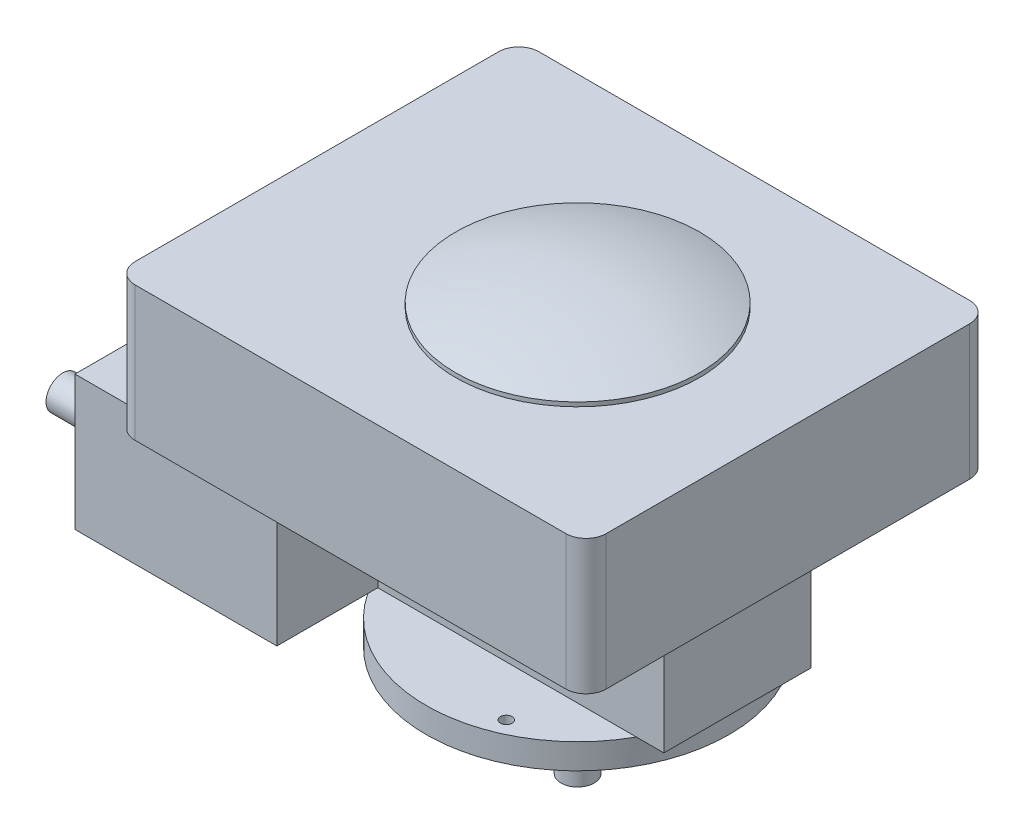
ISO-10303-21;
HEADER;
FILE_DESCRIPTION(('STEP AP214'),'2;1');
FILE_NAME('part.step','',(''),(''),'','','');
FILE_SCHEMA(('AUTOMOTIVE_DESIGN { 1 0 10303 214 1 1 1 1 }'));
ENDSEC;
DATA;
#1=APPLICATION_CONTEXT('core data for automotive mechanical design processes');
#2=APPLICATION_PROTOCOL_DEFINITION('international standard','automotive_design',2000,#1);
#3=PRODUCT_CONTEXT('',#1,'mechanical');
#4=PRODUCT('Part','Part','',(#3));
#5=PRODUCT_RELATED_PRODUCT_CATEGORY('part','',(#4));
#6=PRODUCT_DEFINITION_FORMATION('','',#4);
#7=PRODUCT_DEFINITION_CONTEXT('part definition',#1,'design');
#8=PRODUCT_DEFINITION('design','',#6,#7);
#9=PRODUCT_DEFINITION_SHAPE('','',#8);
#10=(LENGTH_UNIT() NAMED_UNIT(*) SI_UNIT(.MILLI.,.METRE.));
#11=(NAMED_UNIT(*) PLANE_ANGLE_UNIT() SI_UNIT($,.RADIAN.));
#12=(NAMED_UNIT(*) SI_UNIT($,.STERADIAN.) SOLID_ANGLE_UNIT());
#13=UNCERTAINTY_MEASURE_WITH_UNIT(LENGTH_MEASURE(1.E-05),#10,'distance_accuracy_value','');
#14=(GEOMETRIC_REPRESENTATION_CONTEXT(3) GLOBAL_UNCERTAINTY_ASSIGNED_CONTEXT((#13)) GLOBAL_UNIT_ASSIGNED_CONTEXT((#10,
#11,#12)) REPRESENTATION_CONTEXT('',''));
#15=CARTESIAN_POINT('',(0.,0.,0.));
#16=DIRECTION('',(0.,0.,1.));
#17=DIRECTION('',(1.,0.,0.));
#18=AXIS2_PLACEMENT_3D('',#15,#16,#17);
#19=CARTESIAN_POINT('',(-247.65,101.6,-55.5625));
#20=DIRECTION('',(1.,0.,0.));
#21=DIRECTION('',(0.,0.,-1.));
#22=AXIS2_PLACEMENT_3D('',#19,#20,#21);
#23=PLANE('',#22);
#24=DIRECTION('',(0.,0.,1.));
#25=VECTOR('',#24,1.);
#26=CARTESIAN_POINT('',(-247.65,0.,-55.5625));
#27=LINE('',#26,#25);
#28=CARTESIAN_POINT('',(-247.65,0.,-55.5625));
#29=VERTEX_POINT('',#28);
#30=CARTESIAN_POINT('',(-247.65,0.,131.7625));
#31=VERTEX_POINT('',#30);
#32=EDGE_CURVE('E162',#29,#31,#27,.T.);
#33=ORIENTED_EDGE('',*,*,#32,.T.);
#34=DIRECTION('',(0.,-1.,0.));
#35=VECTOR('',#34,1.);
#36=CARTESIAN_POINT('',(-247.65,101.6,131.7625));
#37=LINE('',#36,#35);
#38=CARTESIAN_POINT('',(-247.65,101.6,131.7625));
#39=VERTEX_POINT('',#38);
#40=EDGE_CURVE('E167',#39,#31,#37,.T.);
#41=ORIENTED_EDGE('',*,*,#40,.F.);
#42=DIRECTION('',(0.,0.,1.));
#43=VECTOR('',#42,1.);
#44=CARTESIAN_POINT('',(-247.65,101.6,-55.5625));
#45=LINE('',#44,#43);
#46=CARTESIAN_POINT('',(-247.65,101.6,-55.5625));
#47=VERTEX_POINT('',#46);
#48=EDGE_CURVE('E255',#47,#39,#45,.T.);
#49=ORIENTED_EDGE('',*,*,#48,.F.);
#50=DIRECTION('',(0.,-1.,0.));
#51=VECTOR('',#50,1.);
#52=CARTESIAN_POINT('',(-247.65,101.6,-55.5625));
#53=LINE('',#52,#51);
#54=EDGE_CURVE('E169',#47,#29,#53,.T.);
#55=ORIENTED_EDGE('',*,*,#54,.T.);
#56=EDGE_LOOP('',(#33,#41,#49,#55));
#57=FACE_BOUND('',#56,.T.);
#58=CARTESIAN_POINT('',(-247.65,68.8677449307698,115.540395057253));
#59=DIRECTION('',(1.,0.,0.));
#60=DIRECTION('',(0.,0.,-1.));
#61=AXIS2_PLACEMENT_3D('',#58,#59,#60);
#62=CIRCLE('',#61,12.660326574358);
#63=CARTESIAN_POINT('',(-247.65,68.8677449307698,102.880068482895));
#64=VERTEX_POINT('',#63);
#65=EDGE_CURVE('E12',#64,#64,#62,.F.);
#66=ORIENTED_EDGE('',*,*,#65,.F.);
#67=EDGE_LOOP('',(#66));
#68=FACE_BOUND('',#67,.T.);
#69=ADVANCED_FACE('F39',(#57,#68),#23,.F.);
#70=CARTESIAN_POINT('',(-247.65,101.6,55.5625));
#71=DIRECTION('',(0.,0.,-1.));
#72=DIRECTION('',(-1.,0.,0.));
#73=AXIS2_PLACEMENT_3D('',#70,#71,#72);
#74=PLANE('',#73);
#75=DIRECTION('',(0.,1.,0.));
#76=VECTOR('',#75,1.);
#77=CARTESIAN_POINT('',(-95.2499999999999,101.6,55.5625));
#78=LINE('',#77,#76);
#79=CARTESIAN_POINT('',(-95.2499999999999,0.,55.5625));
#80=VERTEX_POINT('',#79);
#81=CARTESIAN_POINT('',(-95.2499999999999,101.6,55.5625));
#82=VERTEX_POINT('',#81);
#83=EDGE_CURVE('E54',#80,#82,#78,.T.);
#84=ORIENTED_EDGE('',*,*,#83,.F.);
#85=DIRECTION('',(1.,0.,0.));
#86=VECTOR('',#85,1.);
#87=CARTESIAN_POINT('',(-247.65,0.,55.5625));
#88=LINE('',#87,#86);
#89=CARTESIAN_POINT('',(99.886428476295,0.,55.5625));
#90=VERTEX_POINT('',#89);
#91=EDGE_CURVE('E251',#80,#90,#88,.T.);
#92=ORIENTED_EDGE('',*,*,#91,.T.);
#93=CARTESIAN_POINT('',(120.65,0.,55.5625));
#94=VERTEX_POINT('',#93);
#95=EDGE_CURVE('E170',#90,#94,#88,.T.);
#96=ORIENTED_EDGE('',*,*,#95,.T.);
#97=DIRECTION('',(0.,-1.,0.));
#98=VECTOR('',#97,1.);
#99=CARTESIAN_POINT('',(120.65,101.6,55.5625));
#100=LINE('',#99,#98);
#101=CARTESIAN_POINT('',(120.65,101.6,55.5625));
#102=VERTEX_POINT('',#101);
#103=EDGE_CURVE('E259',#102,#94,#100,.T.);
#104=ORIENTED_EDGE('',*,*,#103,.F.);
#105=DIRECTION('',(1.,0.,0.));
#106=VECTOR('',#105,1.);
#107=CARTESIAN_POINT('',(-247.65,101.6,55.5625));
#108=LINE('',#107,#106);
#109=EDGE_CURVE('E257',#82,#102,#108,.T.);
#110=ORIENTED_EDGE('',*,*,#109,.F.);
#111=EDGE_LOOP('',(#84,#92,#96,#104,#110));
#112=FACE_BOUND('',#111,.T.);
#113=ADVANCED_FACE('F384',(#112),#74,.F.);
#114=CARTESIAN_POINT('',(0.,0.,0.));
#115=DIRECTION('',(0.,-1.,0.));
#116=DIRECTION('',(0.,0.,-1.));
#117=AXIS2_PLACEMENT_3D('',#114,#115,#116);
#118=PLANE('',#117);
#119=CARTESIAN_POINT('',(39.624,0.,93.472));
#120=DIRECTION('',(0.,-1.,0.));
#121=DIRECTION('',(0.,0.,-1.));
#122=AXIS2_PLACEMENT_3D('',#119,#120,#121);
#123=CIRCLE('',#122,4.365625);
#124=CARTESIAN_POINT('',(39.624,0.,89.106375));
#125=VERTEX_POINT('',#124);
#126=EDGE_CURVE('E412',#125,#125,#123,.F.);
#127=ORIENTED_EDGE('',*,*,#126,.F.);
#128=EDGE_LOOP('',(#127));
#129=FACE_BOUND('',#128,.T.);
#130=DIRECTION('',(0.,0.,-1.));
#131=VECTOR('',#130,1.);
#132=CARTESIAN_POINT('',(-95.25,0.,131.7625));
#133=LINE('',#132,#131);
#134=CARTESIAN_POINT('',(-95.25,0.,63.1817022562704));
#135=VERTEX_POINT('',#134);
#136=EDGE_CURVE('E198',#135,#80,#133,.T.);
#137=ORIENTED_EDGE('',*,*,#136,.F.);
#138=CARTESIAN_POINT('',(0.,0.,0.));
#139=DIRECTION('',(0.,-1.,0.));
#140=DIRECTION('',(0.,0.,-1.));
#141=AXIS2_PLACEMENT_3D('',#138,#139,#140);
#142=CIRCLE('',#141,114.3);
#143=EDGE_CURVE('E246',#90,#135,#142,.T.);
#144=ORIENTED_EDGE('',*,*,#143,.F.);
#145=ORIENTED_EDGE('',*,*,#91,.F.);
#146=EDGE_LOOP('',(#137,#144,#145));
#147=FACE_BOUND('',#146,.T.);
#148=ADVANCED_FACE('F390',(#129,#147),#118,.F.);
#149=CARTESIAN_POINT('',(0.,101.6,0.));
#150=DIRECTION('',(0.,-1.,0.));
#151=DIRECTION('',(0.,0.,-1.));
#152=AXIS2_PLACEMENT_3D('',#149,#150,#151);
#153=PLANE('',#152);
#154=DIRECTION('',(-1.,0.,0.));
#155=VECTOR('',#154,1.);
#156=CARTESIAN_POINT('',(-247.65,101.6,131.7625));
#157=LINE('',#156,#155);
#158=CARTESIAN_POINT('',(-95.2499999999999,101.6,131.7625));
#159=VERTEX_POINT('',#158);
#160=CARTESIAN_POINT('',(-196.85,101.6,131.7625));
#161=VERTEX_POINT('',#160);
#162=EDGE_CURVE('E194',#159,#161,#157,.T.);
#163=ORIENTED_EDGE('',*,*,#162,.F.);
#164=DIRECTION('',(0.,0.,-1.));
#165=VECTOR('',#164,1.);
#166=CARTESIAN_POINT('',(-95.2499999999999,101.6,131.7625));
#167=LINE('',#166,#165);
#168=EDGE_CURVE('E195',#159,#82,#167,.T.);
#169=ORIENTED_EDGE('',*,*,#168,.T.);
#170=ORIENTED_EDGE('',*,*,#109,.T.);
#171=DIRECTION('',(0.,0.,-1.));
#172=VECTOR('',#171,1.);
#173=CARTESIAN_POINT('',(120.65,101.6,-55.5625));
#174=LINE('',#173,#172);
#175=CARTESIAN_POINT('',(120.65,101.6,-55.5625));
#176=VERTEX_POINT('',#175);
#177=EDGE_CURVE('E247',#102,#176,#174,.T.);
#178=ORIENTED_EDGE('',*,*,#177,.T.);
#179=DIRECTION('',(-1.,0.,0.));
#180=VECTOR('',#179,1.);
#181=CARTESIAN_POINT('',(-247.65,101.6,-55.5625));
#182=LINE('',#181,#180);
#183=CARTESIAN_POINT('',(-196.85,101.6,-55.5625));
#184=VERTEX_POINT('',#183);
#185=EDGE_CURVE('E252',#176,#184,#182,.T.);
#186=ORIENTED_EDGE('',*,*,#185,.T.);
#187=DIRECTION('',(0.,0.,1.));
#188=VECTOR('',#187,1.);
#189=CARTESIAN_POINT('',(-196.85,101.6,152.4));
#190=LINE('',#189,#188);
#191=CARTESIAN_POINT('',(-196.85,101.6,-137.16));
#192=VERTEX_POINT('',#191);
#193=EDGE_CURVE('E222',#192,#184,#190,.T.);
#194=ORIENTED_EDGE('',*,*,#193,.F.);
#195=CARTESIAN_POINT('',(-181.61,101.6,-137.16));
#196=DIRECTION('',(0.,-1.,0.));
#197=DIRECTION('',(0.,0.,-1.));
#198=AXIS2_PLACEMENT_3D('',#195,#196,#197);
#199=CIRCLE('',#198,15.24);
#200=CARTESIAN_POINT('',(-181.61,101.6,-152.4));
#201=VERTEX_POINT('',#200);
#202=EDGE_CURVE('E290',#192,#201,#199,.T.);
#203=ORIENTED_EDGE('',*,*,#202,.T.);
#204=DIRECTION('',(-1.,0.,0.));
#205=VECTOR('',#204,1.);
#206=CARTESIAN_POINT('',(-196.85,101.6,-152.4));
#207=LINE('',#206,#205);
#208=CARTESIAN_POINT('',(143.51,101.6,-152.4));
#209=VERTEX_POINT('',#208);
#210=EDGE_CURVE('E218',#209,#201,#207,.T.);
#211=ORIENTED_EDGE('',*,*,#210,.F.);
#212=CARTESIAN_POINT('',(143.51,101.6,-137.16));
#213=DIRECTION('',(0.,-1.,0.));
#214=DIRECTION('',(0.,0.,-1.));
#215=AXIS2_PLACEMENT_3D('',#212,#213,#214);
#216=CIRCLE('',#215,15.24);
#217=CARTESIAN_POINT('',(158.75,101.6,-137.16));
#218=VERTEX_POINT('',#217);
#219=EDGE_CURVE('E288',#209,#218,#216,.T.);
#220=ORIENTED_EDGE('',*,*,#219,.T.);
#221=DIRECTION('',(0.,0.,-1.));
#222=VECTOR('',#221,1.);
#223=CARTESIAN_POINT('',(158.75,101.6,152.4));
#224=LINE('',#223,#222);
#225=CARTESIAN_POINT('',(158.75,101.6,137.16));
#226=VERTEX_POINT('',#225);
#227=EDGE_CURVE('E215',#226,#218,#224,.T.);
#228=ORIENTED_EDGE('',*,*,#227,.F.);
#229=CARTESIAN_POINT('',(143.51,101.6,137.16));
#230=DIRECTION('',(0.,-1.,0.));
#231=DIRECTION('',(0.,0.,-1.));
#232=AXIS2_PLACEMENT_3D('',#229,#230,#231);
#233=CIRCLE('',#232,15.24);
#234=CARTESIAN_POINT('',(143.51,101.6,152.4));
#235=VERTEX_POINT('',#234);
#236=EDGE_CURVE('E286',#226,#235,#233,.T.);
#237=ORIENTED_EDGE('',*,*,#236,.T.);
#238=DIRECTION('',(1.,0.,0.));
#239=VECTOR('',#238,1.);
#240=CARTESIAN_POINT('',(-196.85,101.6,152.4));
#241=LINE('',#240,#239);
#242=CARTESIAN_POINT('',(-181.61,101.6,152.4));
#243=VERTEX_POINT('',#242);
#244=EDGE_CURVE('E205',#243,#235,#241,.T.);
#245=ORIENTED_EDGE('',*,*,#244,.F.);
#246=CARTESIAN_POINT('',(-181.61,101.6,137.16));
#247=DIRECTION('',(0.,-1.,0.));
#248=DIRECTION('',(0.,0.,-1.));
#249=AXIS2_PLACEMENT_3D('',#246,#247,#248);
#250=CIRCLE('',#249,15.24);
#251=CARTESIAN_POINT('',(-196.85,101.6,137.16));
#252=VERTEX_POINT('',#251);
#253=EDGE_CURVE('E283',#243,#252,#250,.T.);
#254=ORIENTED_EDGE('',*,*,#253,.T.);
#255=EDGE_CURVE('E221',#161,#252,#190,.T.);
#256=ORIENTED_EDGE('',*,*,#255,.F.);
#257=EDGE_LOOP('',(#163,#169,#170,#178,#186,#194,#203,#211,#220,#228,#237,#245,#254,#256));
#258=FACE_BOUND('',#257,.T.);
#259=ADVANCED_FACE('F332',(#258),#153,.T.);
#260=CARTESIAN_POINT('',(0.,203.2,0.));
#261=DIRECTION('',(0.,-1.,0.));
#262=DIRECTION('',(0.,0.,-1.));
#263=AXIS2_PLACEMENT_3D('',#260,#261,#262);
#264=PLANE('',#263);
#265=DIRECTION('',(-1.,0.,0.));
#266=VECTOR('',#265,1.);
#267=CARTESIAN_POINT('',(-196.85,203.2,-152.4));
#268=LINE('',#267,#266);
#269=CARTESIAN_POINT('',(143.51,203.2,-152.4));
#270=VERTEX_POINT('',#269);
#271=CARTESIAN_POINT('',(-181.61,203.2,-152.4));
#272=VERTEX_POINT('',#271);
#273=EDGE_CURVE('E204',#270,#272,#268,.T.);
#274=ORIENTED_EDGE('',*,*,#273,.T.);
#275=CARTESIAN_POINT('',(-181.61,203.2,-137.16));
#276=DIRECTION('',(0.,-1.,0.));
#277=DIRECTION('',(0.,0.,-1.));
#278=AXIS2_PLACEMENT_3D('',#275,#276,#277);
#279=CIRCLE('',#278,15.24);
#280=CARTESIAN_POINT('',(-196.85,203.2,-137.16));
#281=VERTEX_POINT('',#280);
#282=EDGE_CURVE('E303',#272,#281,#279,.F.);
#283=ORIENTED_EDGE('',*,*,#282,.T.);
#284=DIRECTION('',(0.,0.,1.));
#285=VECTOR('',#284,1.);
#286=CARTESIAN_POINT('',(-196.85,203.2,152.4));
#287=LINE('',#286,#285);
#288=CARTESIAN_POINT('',(-196.85,203.2,137.16));
#289=VERTEX_POINT('',#288);
#290=EDGE_CURVE('E208',#281,#289,#287,.T.);
#291=ORIENTED_EDGE('',*,*,#290,.T.);
#292=CARTESIAN_POINT('',(-181.61,203.2,137.16));
#293=DIRECTION('',(0.,-1.,0.));
#294=DIRECTION('',(0.,0.,-1.));
#295=AXIS2_PLACEMENT_3D('',#292,#293,#294);
#296=CIRCLE('',#295,15.24);
#297=CARTESIAN_POINT('',(-181.61,203.2,152.4));
#298=VERTEX_POINT('',#297);
#299=EDGE_CURVE('E297',#289,#298,#296,.F.);
#300=ORIENTED_EDGE('',*,*,#299,.T.);
#301=DIRECTION('',(1.,0.,0.));
#302=VECTOR('',#301,1.);
#303=CARTESIAN_POINT('',(-196.85,203.2,152.4));
#304=LINE('',#303,#302);
#305=CARTESIAN_POINT('',(143.51,203.2,152.4));
#306=VERTEX_POINT('',#305);
#307=EDGE_CURVE('E211',#298,#306,#304,.T.);
#308=ORIENTED_EDGE('',*,*,#307,.T.);
#309=CARTESIAN_POINT('',(143.51,203.2,137.16));
#310=DIRECTION('',(0.,-1.,0.));
#311=DIRECTION('',(0.,0.,-1.));
#312=AXIS2_PLACEMENT_3D('',#309,#310,#311);
#313=CIRCLE('',#312,15.24);
#314=CARTESIAN_POINT('',(158.75,203.2,137.16));
#315=VERTEX_POINT('',#314);
#316=EDGE_CURVE('E299',#306,#315,#313,.F.);
#317=ORIENTED_EDGE('',*,*,#316,.T.);
#318=DIRECTION('',(0.,0.,-1.));
#319=VECTOR('',#318,1.);
#320=CARTESIAN_POINT('',(158.75,203.2,152.4));
#321=LINE('',#320,#319);
#322=CARTESIAN_POINT('',(158.75,203.2,-137.16));
#323=VERTEX_POINT('',#322);
#324=EDGE_CURVE('E201',#315,#323,#321,.T.);
#325=ORIENTED_EDGE('',*,*,#324,.T.);
#326=CARTESIAN_POINT('',(143.51,203.2,-137.16));
#327=DIRECTION('',(0.,-1.,0.));
#328=DIRECTION('',(0.,0.,-1.));
#329=AXIS2_PLACEMENT_3D('',#326,#327,#328);
#330=CIRCLE('',#329,15.24);
#331=EDGE_CURVE('E301',#323,#270,#330,.F.);
#332=ORIENTED_EDGE('',*,*,#331,.T.);
#333=EDGE_LOOP('',(#274,#283,#291,#300,#308,#317,#325,#332));
#334=FACE_BOUND('',#333,.T.);
#335=CARTESIAN_POINT('',(0.,203.2,0.));
#336=DIRECTION('',(0.,-1.,0.));
#337=DIRECTION('',(0.,0.,-1.));
#338=AXIS2_PLACEMENT_3D('',#335,#336,#337);
#339=CIRCLE('',#338,92.075);
#340=CARTESIAN_POINT('',(0.,203.2,-92.075));
#341=VERTEX_POINT('',#340);
#342=EDGE_CURVE('E273',#341,#341,#339,.F.);
#343=ORIENTED_EDGE('',*,*,#342,.F.);
#344=EDGE_LOOP('',(#343));
#345=FACE_BOUND('',#344,.T.);
#346=ADVANCED_FACE('F321',(#334,#345),#264,.F.);
#347=CARTESIAN_POINT('',(0.,-31.75,0.));
#348=DIRECTION('',(0.,-1.,0.));
#349=DIRECTION('',(0.,0.,-1.));
#350=AXIS2_PLACEMENT_3D('',#347,#348,#349);
#351=PLANE('',#350);
#352=CARTESIAN_POINT('',(0.,-31.75,0.));
#353=DIRECTION('',(0.,-1.,0.));
#354=DIRECTION('',(0.,0.,-1.));
#355=AXIS2_PLACEMENT_3D('',#352,#353,#354);
#356=CIRCLE('',#355,87.63);
#357=CARTESIAN_POINT('',(0.,-31.75,-87.63));
#358=VERTEX_POINT('',#357);
#359=EDGE_CURVE('E233',#358,#358,#356,.T.);
#360=ORIENTED_EDGE('',*,*,#359,.T.);
#361=EDGE_LOOP('',(#360));
#362=FACE_BOUND('',#361,.T.);
#363=CARTESIAN_POINT('',(0.,-31.75,0.));
#364=DIRECTION('',(0.,-1.,0.));
#365=DIRECTION('',(0.,0.,-1.));
#366=AXIS2_PLACEMENT_3D('',#363,#364,#365);
#367=CIRCLE('',#366,12.5);
#368=CARTESIAN_POINT('',(0.,-31.75,-12.5));
#369=VERTEX_POINT('',#368);
#370=EDGE_CURVE('E214',#369,#369,#367,.T.);
#371=ORIENTED_EDGE('',*,*,#370,.F.);
#372=EDGE_LOOP('',(#371));
#373=FACE_BOUND('',#372,.T.);
#374=ADVANCED_FACE('F467',(#362,#373),#351,.T.);
#375=CARTESIAN_POINT('',(0.,-19.05,0.));
#376=DIRECTION('',(0.,-1.,0.));
#377=DIRECTION('',(0.,0.,-1.));
#378=AXIS2_PLACEMENT_3D('',#375,#376,#377);
#379=PLANE('',#378);
#380=CARTESIAN_POINT('',(-81.28,-19.05,-61.214));
#381=DIRECTION('',(0.,-1.,0.));
#382=DIRECTION('',(0.,0.,-1.));
#383=AXIS2_PLACEMENT_3D('',#380,#381,#382);
#384=CIRCLE('',#383,4.365625);
#385=CARTESIAN_POINT('',(-81.28,-19.05,-65.579625));
#386=VERTEX_POINT('',#385);
#387=EDGE_CURVE('E427',#386,#386,#384,.T.);
#388=ORIENTED_EDGE('',*,*,#387,.F.);
#389=EDGE_LOOP('',(#388));
#390=FACE_BOUND('',#389,.T.);
#391=CARTESIAN_POINT('',(76.708,-19.05,-66.548));
#392=DIRECTION('',(0.,-1.,0.));
#393=DIRECTION('',(0.,0.,-1.));
#394=AXIS2_PLACEMENT_3D('',#391,#392,#393);
#395=CIRCLE('',#394,4.365625);
#396=CARTESIAN_POINT('',(76.708,-19.05,-70.913625));
#397=VERTEX_POINT('',#396);
#398=EDGE_CURVE('E420',#397,#397,#395,.T.);
#399=ORIENTED_EDGE('',*,*,#398,.F.);
#400=EDGE_LOOP('',(#399));
#401=FACE_BOUND('',#400,.T.);
#402=CARTESIAN_POINT('',(39.624,-19.05,93.472));
#403=DIRECTION('',(0.,-1.,0.));
#404=DIRECTION('',(0.,0.,-1.));
#405=AXIS2_PLACEMENT_3D('',#402,#403,#404);
#406=CIRCLE('',#405,4.365625);
#407=CARTESIAN_POINT('',(39.624,-19.05,89.106375));
#408=VERTEX_POINT('',#407);
#409=EDGE_CURVE('E416',#408,#408,#406,.T.);
#410=ORIENTED_EDGE('',*,*,#409,.F.);
#411=EDGE_LOOP('',(#410));
#412=FACE_BOUND('',#411,.T.);
#413=CARTESIAN_POINT('',(0.,-19.05,0.));
#414=DIRECTION('',(0.,-1.,0.));
#415=DIRECTION('',(0.,0.,-1.));
#416=AXIS2_PLACEMENT_3D('',#413,#414,#415);
#417=CIRCLE('',#416,114.3);
#418=CARTESIAN_POINT('',(0.,-19.05,-114.3));
#419=VERTEX_POINT('',#418);
#420=EDGE_CURVE('E239',#419,#419,#417,.T.);
#421=ORIENTED_EDGE('',*,*,#420,.T.);
#422=EDGE_LOOP('',(#421));
#423=FACE_BOUND('',#422,.T.);
#424=CARTESIAN_POINT('',(0.,-19.05,0.));
#425=DIRECTION('',(0.,-1.,0.));
#426=DIRECTION('',(0.,0.,-1.));
#427=AXIS2_PLACEMENT_3D('',#424,#425,#426);
#428=CIRCLE('',#427,87.63);
#429=CARTESIAN_POINT('',(0.,-19.05,-87.63));
#430=VERTEX_POINT('',#429);
#431=EDGE_CURVE('E230',#430,#430,#428,.T.);
#432=ORIENTED_EDGE('',*,*,#431,.F.);
#433=EDGE_LOOP('',(#432));
#434=FACE_BOUND('',#433,.T.);
#435=ADVANCED_FACE('F488',(#390,#401,#412,#423,#434),#379,.T.);
#436=CARTESIAN_POINT('',(0.,0.,0.));
#437=DIRECTION('',(0.,1.,0.));
#438=DIRECTION('',(0.,0.,1.));
#439=AXIS2_PLACEMENT_3D('',#436,#437,#438);
#440=PLANE('',#439);
#441=CARTESIAN_POINT('',(99.886428476295,0.,-55.5625));
#442=VERTEX_POINT('',#441);
#443=EDGE_CURVE('E243',#442,#90,#142,.T.);
#444=ORIENTED_EDGE('',*,*,#443,.F.);
#445=DIRECTION('',(-1.,0.,0.));
#446=VECTOR('',#445,1.);
#447=CARTESIAN_POINT('',(-247.65,0.,-55.5625));
#448=LINE('',#447,#446);
#449=CARTESIAN_POINT('',(120.65,0.,-55.5625));
#450=VERTEX_POINT('',#449);
#451=EDGE_CURVE('E171',#450,#442,#448,.T.);
#452=ORIENTED_EDGE('',*,*,#451,.F.);
#453=DIRECTION('',(0.,0.,-1.));
#454=VECTOR('',#453,1.);
#455=CARTESIAN_POINT('',(120.65,0.,-55.5625));
#456=LINE('',#455,#454);
#457=EDGE_CURVE('E242',#94,#450,#456,.T.);
#458=ORIENTED_EDGE('',*,*,#457,.F.);
#459=ORIENTED_EDGE('',*,*,#95,.F.);
#460=EDGE_LOOP('',(#444,#452,#458,#459));
#461=FACE_BOUND('',#460,.T.);
#462=ADVANCED_FACE('F362',(#461),#440,.F.);
#463=CARTESIAN_POINT('',(-99.886428476295,0.,-55.5625));
#464=VERTEX_POINT('',#463);
#465=EDGE_CURVE('E62',#135,#464,#142,.T.);
#466=ORIENTED_EDGE('',*,*,#465,.F.);
#467=CARTESIAN_POINT('',(-95.25,0.,131.7625));
#468=VERTEX_POINT('',#467);
#469=EDGE_CURVE('E176',#468,#135,#133,.T.);
#470=ORIENTED_EDGE('',*,*,#469,.F.);
#471=DIRECTION('',(1.,0.,0.));
#472=VECTOR('',#471,1.);
#473=CARTESIAN_POINT('',(-247.65,0.,131.7625));
#474=LINE('',#473,#472);
#475=EDGE_CURVE('E173',#31,#468,#474,.T.);
#476=ORIENTED_EDGE('',*,*,#475,.F.);
#477=ORIENTED_EDGE('',*,*,#32,.F.);
#478=EDGE_CURVE('E262',#464,#29,#448,.T.);
#479=ORIENTED_EDGE('',*,*,#478,.F.);
#480=EDGE_LOOP('',(#466,#470,#476,#477,#479));
#481=FACE_BOUND('',#480,.T.);
#482=ADVANCED_FACE('F174',(#481),#440,.F.);
#483=CARTESIAN_POINT('',(120.65,101.6,-55.5625));
#484=DIRECTION('',(-1.,0.,0.));
#485=DIRECTION('',(0.,0.,1.));
#486=AXIS2_PLACEMENT_3D('',#483,#484,#485);
#487=PLANE('',#486);
#488=ORIENTED_EDGE('',*,*,#457,.T.);
#489=DIRECTION('',(0.,-1.,0.));
#490=VECTOR('',#489,1.);
#491=CARTESIAN_POINT('',(120.65,101.6,-55.5625));
#492=LINE('',#491,#490);
#493=EDGE_CURVE('E270',#176,#450,#492,.T.);
#494=ORIENTED_EDGE('',*,*,#493,.F.);
#495=ORIENTED_EDGE('',*,*,#177,.F.);
#496=ORIENTED_EDGE('',*,*,#103,.T.);
#497=EDGE_LOOP('',(#488,#494,#495,#496));
#498=FACE_BOUND('',#497,.T.);
#499=ADVANCED_FACE('F357',(#498),#487,.F.);
#500=CARTESIAN_POINT('',(-247.65,101.6,-55.5625));
#501=DIRECTION('',(0.,0.,1.));
#502=DIRECTION('',(1.,0.,0.));
#503=AXIS2_PLACEMENT_3D('',#500,#501,#502);
#504=PLANE('',#503);
#505=ORIENTED_EDGE('',*,*,#451,.T.);
#506=EDGE_CURVE('E264',#442,#464,#448,.T.);
#507=ORIENTED_EDGE('',*,*,#506,.T.);
#508=ORIENTED_EDGE('',*,*,#478,.T.);
#509=ORIENTED_EDGE('',*,*,#54,.F.);
#510=EDGE_CURVE('E250',#184,#47,#182,.T.);
#511=ORIENTED_EDGE('',*,*,#510,.F.);
#512=ORIENTED_EDGE('',*,*,#185,.F.);
#513=ORIENTED_EDGE('',*,*,#493,.T.);
#514=EDGE_LOOP('',(#505,#507,#508,#509,#511,#512,#513));
#515=FACE_BOUND('',#514,.T.);
#516=ADVANCED_FACE('F355',(#515),#504,.F.);
#517=CARTESIAN_POINT('',(0.,101.6,0.));
#518=DIRECTION('',(0.,1.,0.));
#519=DIRECTION('',(0.,0.,1.));
#520=AXIS2_PLACEMENT_3D('',#517,#518,#519);
#521=PLANE('',#520);
#522=EDGE_CURVE('E224',#184,#161,#190,.T.);
#523=ORIENTED_EDGE('',*,*,#522,.F.);
#524=ORIENTED_EDGE('',*,*,#510,.T.);
#525=ORIENTED_EDGE('',*,*,#48,.T.);
#526=EDGE_CURVE('E186',#161,#39,#157,.T.);
#527=ORIENTED_EDGE('',*,*,#526,.F.);
#528=EDGE_LOOP('',(#523,#524,#525,#527));
#529=FACE_BOUND('',#528,.T.);
#530=ADVANCED_FACE('F498',(#529),#521,.T.);
#531=CARTESIAN_POINT('',(0.,-19.05,0.));
#532=DIRECTION('',(0.,1.,0.));
#533=DIRECTION('',(0.,0.,1.));
#534=AXIS2_PLACEMENT_3D('',#531,#532,#533);
#535=CYLINDRICAL_SURFACE('',#534,114.3);
#536=ORIENTED_EDGE('',*,*,#420,.F.);
#537=EDGE_LOOP('',(#536));
#538=FACE_BOUND('',#537,.T.);
#539=ORIENTED_EDGE('',*,*,#443,.T.);
#540=ORIENTED_EDGE('',*,*,#143,.T.);
#541=ORIENTED_EDGE('',*,*,#465,.T.);
#542=EDGE_CURVE('E236',#464,#442,#142,.T.);
#543=ORIENTED_EDGE('',*,*,#542,.T.);
#544=EDGE_LOOP('',(#539,#540,#541,#543));
#545=FACE_BOUND('',#544,.T.);
#546=ADVANCED_FACE('F370',(#538,#545),#535,.T.);
#547=CARTESIAN_POINT('',(-81.28,0.,-61.214));
#548=DIRECTION('',(0.,-1.,0.));
#549=DIRECTION('',(0.,0.,-1.));
#550=AXIS2_PLACEMENT_3D('',#547,#548,#549);
#551=CIRCLE('',#550,4.365625);
#552=CARTESIAN_POINT('',(-81.28,0.,-65.579625));
#553=VERTEX_POINT('',#552);
#554=EDGE_CURVE('E430',#553,#553,#551,.F.);
#555=ORIENTED_EDGE('',*,*,#554,.F.);
#556=EDGE_LOOP('',(#555));
#557=FACE_BOUND('',#556,.T.);
#558=CARTESIAN_POINT('',(76.708,0.,-66.548));
#559=DIRECTION('',(0.,-1.,0.));
#560=DIRECTION('',(0.,0.,-1.));
#561=AXIS2_PLACEMENT_3D('',#558,#559,#560);
#562=CIRCLE('',#561,4.365625);
#563=CARTESIAN_POINT('',(76.708,0.,-70.913625));
#564=VERTEX_POINT('',#563);
#565=EDGE_CURVE('E424',#564,#564,#562,.F.);
#566=ORIENTED_EDGE('',*,*,#565,.F.);
#567=EDGE_LOOP('',(#566));
#568=FACE_BOUND('',#567,.T.);
#569=ORIENTED_EDGE('',*,*,#506,.F.);
#570=ORIENTED_EDGE('',*,*,#542,.F.);
#571=EDGE_LOOP('',(#569,#570));
#572=FACE_BOUND('',#571,.T.);
#573=ADVANCED_FACE('F368',(#557,#568,#572),#118,.F.);
#574=CARTESIAN_POINT('',(0.,-31.75,0.));
#575=DIRECTION('',(0.,1.,0.));
#576=DIRECTION('',(0.,0.,1.));
#577=AXIS2_PLACEMENT_3D('',#574,#575,#576);
#578=CYLINDRICAL_SURFACE('',#577,87.63);
#579=ORIENTED_EDGE('',*,*,#359,.F.);
#580=EDGE_LOOP('',(#579));
#581=FACE_BOUND('',#580,.T.);
#582=ORIENTED_EDGE('',*,*,#431,.T.);
#583=EDGE_LOOP('',(#582));
#584=FACE_BOUND('',#583,.T.);
#585=ADVANCED_FACE('F438',(#581,#584),#578,.T.);
#586=CARTESIAN_POINT('',(0.,-101.6,0.));
#587=DIRECTION('',(0.,1.,0.));
#588=DIRECTION('',(0.,0.,1.));
#589=AXIS2_PLACEMENT_3D('',#586,#587,#588);
#590=CYLINDRICAL_SURFACE('',#589,12.5);
#591=CARTESIAN_POINT('',(0.,-101.6,0.));
#592=DIRECTION('',(0.,-1.,0.));
#593=DIRECTION('',(0.,0.,-1.));
#594=AXIS2_PLACEMENT_3D('',#591,#592,#593);
#595=CIRCLE('',#594,12.5);
#596=CARTESIAN_POINT('',(0.,-101.6,-12.5));
#597=VERTEX_POINT('',#596);
#598=EDGE_CURVE('E227',#597,#597,#595,.T.);
#599=ORIENTED_EDGE('',*,*,#598,.F.);
#600=EDGE_LOOP('',(#599));
#601=FACE_BOUND('',#600,.T.);
#602=ORIENTED_EDGE('',*,*,#370,.T.);
#603=EDGE_LOOP('',(#602));
#604=FACE_BOUND('',#603,.T.);
#605=ADVANCED_FACE('F481',(#601,#604),#590,.T.);
#606=CARTESIAN_POINT('',(0.,-101.6,0.));
#607=DIRECTION('',(0.,-1.,0.));
#608=DIRECTION('',(0.,0.,-1.));
#609=AXIS2_PLACEMENT_3D('',#606,#607,#608);
#610=PLANE('',#609);
#611=ORIENTED_EDGE('',*,*,#598,.T.);
#612=EDGE_LOOP('',(#611));
#613=FACE_BOUND('',#612,.T.);
#614=ADVANCED_FACE('F478',(#613),#610,.T.);
#615=CARTESIAN_POINT('',(158.75,203.2,152.4));
#616=DIRECTION('',(-1.,0.,0.));
#617=DIRECTION('',(0.,0.,1.));
#618=AXIS2_PLACEMENT_3D('',#615,#616,#617);
#619=PLANE('',#618);
#620=ORIENTED_EDGE('',*,*,#227,.T.);
#621=DIRECTION('',(0.,-1.,0.));
#622=VECTOR('',#621,1.);
#623=CARTESIAN_POINT('',(158.75,203.2,-137.16));
#624=LINE('',#623,#622);
#625=EDGE_CURVE('E308',#218,#323,#624,.F.);
#626=ORIENTED_EDGE('',*,*,#625,.T.);
#627=ORIENTED_EDGE('',*,*,#324,.F.);
#628=DIRECTION('',(0.,-1.,0.));
#629=VECTOR('',#628,1.);
#630=CARTESIAN_POINT('',(158.75,203.2,137.16));
#631=LINE('',#630,#629);
#632=EDGE_CURVE('E305',#315,#226,#631,.T.);
#633=ORIENTED_EDGE('',*,*,#632,.T.);
#634=EDGE_LOOP('',(#620,#626,#627,#633));
#635=FACE_BOUND('',#634,.T.);
#636=ADVANCED_FACE('F329',(#635),#619,.F.);
#637=CARTESIAN_POINT('',(-196.85,203.2,-152.4));
#638=DIRECTION('',(0.,0.,1.));
#639=DIRECTION('',(1.,0.,0.));
#640=AXIS2_PLACEMENT_3D('',#637,#638,#639);
#641=PLANE('',#640);
#642=ORIENTED_EDGE('',*,*,#210,.T.);
#643=DIRECTION('',(0.,-1.,0.));
#644=VECTOR('',#643,1.);
#645=CARTESIAN_POINT('',(-181.61,203.2,-152.4));
#646=LINE('',#645,#644);
#647=EDGE_CURVE('E295',#201,#272,#646,.F.);
#648=ORIENTED_EDGE('',*,*,#647,.T.);
#649=ORIENTED_EDGE('',*,*,#273,.F.);
#650=DIRECTION('',(0.,-1.,0.));
#651=VECTOR('',#650,1.);
#652=CARTESIAN_POINT('',(143.51,203.2,-152.4));
#653=LINE('',#652,#651);
#654=EDGE_CURVE('E292',#270,#209,#653,.T.);
#655=ORIENTED_EDGE('',*,*,#654,.T.);
#656=EDGE_LOOP('',(#642,#648,#649,#655));
#657=FACE_BOUND('',#656,.T.);
#658=ADVANCED_FACE('F340',(#657),#641,.F.);
#659=CARTESIAN_POINT('',(-196.85,203.2,152.4));
#660=DIRECTION('',(1.,0.,0.));
#661=DIRECTION('',(0.,0.,-1.));
#662=AXIS2_PLACEMENT_3D('',#659,#660,#661);
#663=PLANE('',#662);
#664=ORIENTED_EDGE('',*,*,#290,.F.);
#665=DIRECTION('',(0.,-1.,0.));
#666=VECTOR('',#665,1.);
#667=CARTESIAN_POINT('',(-196.85,203.2,-137.16));
#668=LINE('',#667,#666);
#669=EDGE_CURVE('E280',#281,#192,#668,.T.);
#670=ORIENTED_EDGE('',*,*,#669,.T.);
#671=ORIENTED_EDGE('',*,*,#193,.T.);
#672=ORIENTED_EDGE('',*,*,#522,.T.);
#673=ORIENTED_EDGE('',*,*,#255,.T.);
#674=DIRECTION('',(0.,-1.,0.));
#675=VECTOR('',#674,1.);
#676=CARTESIAN_POINT('',(-196.85,203.2,137.16));
#677=LINE('',#676,#675);
#678=EDGE_CURVE('E276',#252,#289,#677,.F.);
#679=ORIENTED_EDGE('',*,*,#678,.T.);
#680=EDGE_LOOP('',(#664,#670,#671,#672,#673,#679));
#681=FACE_BOUND('',#680,.T.);
#682=ADVANCED_FACE('F349',(#681),#663,.F.);
#683=CARTESIAN_POINT('',(-196.85,203.2,152.4));
#684=DIRECTION('',(0.,0.,-1.));
#685=DIRECTION('',(-1.,0.,0.));
#686=AXIS2_PLACEMENT_3D('',#683,#684,#685);
#687=PLANE('',#686);
#688=ORIENTED_EDGE('',*,*,#244,.T.);
#689=DIRECTION('',(0.,-1.,0.));
#690=VECTOR('',#689,1.);
#691=CARTESIAN_POINT('',(143.51,203.2,152.4));
#692=LINE('',#691,#690);
#693=EDGE_CURVE('E47',#235,#306,#692,.F.);
#694=ORIENTED_EDGE('',*,*,#693,.T.);
#695=ORIENTED_EDGE('',*,*,#307,.F.);
#696=DIRECTION('',(0.,-1.,0.));
#697=VECTOR('',#696,1.);
#698=CARTESIAN_POINT('',(-181.61,203.2,152.4));
#699=LINE('',#698,#697);
#700=EDGE_CURVE('E310',#298,#243,#699,.T.);
#701=ORIENTED_EDGE('',*,*,#700,.T.);
#702=EDGE_LOOP('',(#688,#694,#695,#701));
#703=FACE_BOUND('',#702,.T.);
#704=ADVANCED_FACE('F315',(#703),#687,.F.);
#705=CARTESIAN_POINT('',(0.,206.375,0.));
#706=DIRECTION('',(0.,-1.,0.));
#707=DIRECTION('',(0.,0.,-1.));
#708=AXIS2_PLACEMENT_3D('',#705,#706,#707);
#709=CYLINDRICAL_SURFACE('',#708,92.075);
#710=CARTESIAN_POINT('',(0.,206.375,0.));
#711=DIRECTION('',(0.,1.,0.));
#712=DIRECTION('',(0.,0.,1.));
#713=AXIS2_PLACEMENT_3D('',#710,#711,#712);
#714=CIRCLE('',#713,92.075);
#715=CARTESIAN_POINT('',(0.,206.375,92.075));
#716=VERTEX_POINT('',#715);
#717=EDGE_CURVE('E200',#716,#716,#714,.T.);
#718=ORIENTED_EDGE('',*,*,#717,.F.);
#719=EDGE_LOOP('',(#718));
#720=FACE_BOUND('',#719,.T.);
#721=ORIENTED_EDGE('',*,*,#342,.T.);
#722=EDGE_LOOP('',(#721));
#723=FACE_BOUND('',#722,.T.);
#724=ADVANCED_FACE('F460',(#720,#723),#709,.T.);
#725=CARTESIAN_POINT('',(0.,-23.1434821428573,0.));
#726=DIRECTION('',(0.,0.,1.));
#727=DIRECTION('',(1.,0.,0.));
#728=AXIS2_PLACEMENT_3D('',#725,#726,#727);
#729=SPHERICAL_SURFACE('',#728,247.298482142857);
#730=CARTESIAN_POINT('',(0.,-23.1434821428573,0.));
#731=DIRECTION('',(0.,1.,0.));
#732=DIRECTION('',(0.,0.,1.));
#733=AXIS2_PLACEMENT_3D('',#730,#731,#732);
#734=SPHERICAL_SURFACE('',#733,247.298482142857);
#735=ORIENTED_EDGE('',*,*,#717,.T.);
#736=EDGE_LOOP('',(#735));
#737=FACE_BOUND('',#736,.T.);
#738=ADVANCED_FACE('F463',(#737),#734,.T.);
#739=CARTESIAN_POINT('',(-181.61,203.2,-137.16));
#740=DIRECTION('',(0.,-1.,0.));
#741=DIRECTION('',(0.,0.,-1.));
#742=AXIS2_PLACEMENT_3D('',#739,#740,#741);
#743=CYLINDRICAL_SURFACE('',#742,15.24);
#744=ORIENTED_EDGE('',*,*,#282,.F.);
#745=ORIENTED_EDGE('',*,*,#647,.F.);
#746=ORIENTED_EDGE('',*,*,#202,.F.);
#747=ORIENTED_EDGE('',*,*,#669,.F.);
#748=EDGE_LOOP('',(#744,#745,#746,#747));
#749=FACE_BOUND('',#748,.T.);
#750=ADVANCED_FACE('F346',(#749),#743,.T.);
#751=CARTESIAN_POINT('',(143.51,203.2,-137.16));
#752=DIRECTION('',(0.,-1.,0.));
#753=DIRECTION('',(0.,0.,-1.));
#754=AXIS2_PLACEMENT_3D('',#751,#752,#753);
#755=CYLINDRICAL_SURFACE('',#754,15.24);
#756=ORIENTED_EDGE('',*,*,#331,.F.);
#757=ORIENTED_EDGE('',*,*,#625,.F.);
#758=ORIENTED_EDGE('',*,*,#219,.F.);
#759=ORIENTED_EDGE('',*,*,#654,.F.);
#760=EDGE_LOOP('',(#756,#757,#758,#759));
#761=FACE_BOUND('',#760,.T.);
#762=ADVANCED_FACE('F337',(#761),#755,.T.);
#763=CARTESIAN_POINT('',(143.51,203.2,137.16));
#764=DIRECTION('',(0.,-1.,0.));
#765=DIRECTION('',(0.,0.,-1.));
#766=AXIS2_PLACEMENT_3D('',#763,#764,#765);
#767=CYLINDRICAL_SURFACE('',#766,15.24);
#768=ORIENTED_EDGE('',*,*,#316,.F.);
#769=ORIENTED_EDGE('',*,*,#693,.F.);
#770=ORIENTED_EDGE('',*,*,#236,.F.);
#771=ORIENTED_EDGE('',*,*,#632,.F.);
#772=EDGE_LOOP('',(#768,#769,#770,#771));
#773=FACE_BOUND('',#772,.T.);
#774=ADVANCED_FACE('F326',(#773),#767,.T.);
#775=CARTESIAN_POINT('',(-181.61,203.2,137.16));
#776=DIRECTION('',(0.,-1.,0.));
#777=DIRECTION('',(0.,0.,-1.));
#778=AXIS2_PLACEMENT_3D('',#775,#776,#777);
#779=CYLINDRICAL_SURFACE('',#778,15.24);
#780=ORIENTED_EDGE('',*,*,#299,.F.);
#781=ORIENTED_EDGE('',*,*,#678,.F.);
#782=ORIENTED_EDGE('',*,*,#253,.F.);
#783=ORIENTED_EDGE('',*,*,#700,.F.);
#784=EDGE_LOOP('',(#780,#781,#782,#783));
#785=FACE_BOUND('',#784,.T.);
#786=ADVANCED_FACE('F41',(#785),#779,.T.);
#787=CARTESIAN_POINT('',(-95.2499999999999,101.6,131.7625));
#788=DIRECTION('',(-1.,0.,0.));
#789=DIRECTION('',(0.,-1.,0.));
#790=AXIS2_PLACEMENT_3D('',#787,#788,#789);
#791=PLANE('',#790);
#792=ORIENTED_EDGE('',*,*,#83,.T.);
#793=ORIENTED_EDGE('',*,*,#168,.F.);
#794=DIRECTION('',(0.,1.,0.));
#795=VECTOR('',#794,1.);
#796=CARTESIAN_POINT('',(-95.2499999999999,101.6,131.7625));
#797=LINE('',#796,#795);
#798=EDGE_CURVE('E180',#468,#159,#797,.T.);
#799=ORIENTED_EDGE('',*,*,#798,.F.);
#800=ORIENTED_EDGE('',*,*,#469,.T.);
#801=ORIENTED_EDGE('',*,*,#136,.T.);
#802=EDGE_LOOP('',(#792,#793,#799,#800,#801));
#803=FACE_BOUND('',#802,.T.);
#804=ADVANCED_FACE('F376',(#803),#791,.F.);
#805=CARTESIAN_POINT('',(0.,0.,131.7625));
#806=DIRECTION('',(0.,0.,1.));
#807=DIRECTION('',(1.,0.,0.));
#808=AXIS2_PLACEMENT_3D('',#805,#806,#807);
#809=PLANE('',#808);
#810=ORIENTED_EDGE('',*,*,#40,.T.);
#811=ORIENTED_EDGE('',*,*,#475,.T.);
#812=ORIENTED_EDGE('',*,*,#798,.T.);
#813=ORIENTED_EDGE('',*,*,#162,.T.);
#814=ORIENTED_EDGE('',*,*,#526,.T.);
#815=EDGE_LOOP('',(#810,#811,#812,#813,#814));
#816=FACE_BOUND('',#815,.T.);
#817=ADVANCED_FACE('F183',(#816),#809,.T.);
#818=CARTESIAN_POINT('',(-273.05,68.8677449307698,115.540395057253));
#819=DIRECTION('',(-1.,0.,0.));
#820=DIRECTION('',(0.,0.,1.));
#821=AXIS2_PLACEMENT_3D('',#818,#819,#820);
#822=PLANE('',#821);
#823=CARTESIAN_POINT('',(-273.05,68.8677449307698,115.540395057253));
#824=DIRECTION('',(-1.,0.,0.));
#825=DIRECTION('',(0.,0.,1.));
#826=AXIS2_PLACEMENT_3D('',#823,#824,#825);
#827=CIRCLE('',#826,12.660326574358);
#828=CARTESIAN_POINT('',(-273.05,68.8677449307698,128.200721631611));
#829=VERTEX_POINT('',#828);
#830=EDGE_CURVE('E188',#829,#829,#827,.T.);
#831=ORIENTED_EDGE('',*,*,#830,.T.);
#832=EDGE_LOOP('',(#831));
#833=FACE_BOUND('',#832,.T.);
#834=CARTESIAN_POINT('',(-273.05,68.8677449307698,115.540395057253));
#835=DIRECTION('',(-1.,0.,0.));
#836=DIRECTION('',(0.,0.,1.));
#837=AXIS2_PLACEMENT_3D('',#834,#835,#836);
#838=CIRCLE('',#837,10.120326574358);
#839=CARTESIAN_POINT('',(-273.05,68.8677449307698,125.660721631611));
#840=VERTEX_POINT('',#839);
#841=EDGE_CURVE('E411',#840,#840,#838,.T.);
#842=ORIENTED_EDGE('',*,*,#841,.F.);
#843=EDGE_LOOP('',(#842));
#844=FACE_BOUND('',#843,.T.);
#845=ADVANCED_FACE('F451',(#833,#844),#822,.T.);
#846=CARTESIAN_POINT('',(-273.05,68.8677449307698,115.540395057253));
#847=DIRECTION('',(1.,0.,0.));
#848=DIRECTION('',(0.,0.,-1.));
#849=AXIS2_PLACEMENT_3D('',#846,#847,#848);
#850=CYLINDRICAL_SURFACE('',#849,12.660326574358);
#851=ORIENTED_EDGE('',*,*,#830,.F.);
#852=EDGE_LOOP('',(#851));
#853=FACE_BOUND('',#852,.T.);
#854=ORIENTED_EDGE('',*,*,#65,.T.);
#855=EDGE_LOOP('',(#854));
#856=FACE_BOUND('',#855,.T.);
#857=ADVANCED_FACE('F404',(#853,#856),#850,.T.);
#858=CARTESIAN_POINT('',(-273.05,68.8677449307698,115.540395057253));
#859=DIRECTION('',(1.,0.,0.));
#860=DIRECTION('',(0.,0.,-1.));
#861=AXIS2_PLACEMENT_3D('',#858,#859,#860);
#862=CYLINDRICAL_SURFACE('',#861,10.120326574358);
#863=ORIENTED_EDGE('',*,*,#841,.T.);
#864=EDGE_LOOP('',(#863));
#865=FACE_BOUND('',#864,.T.);
#866=CARTESIAN_POINT('',(-247.65,68.8677449307698,115.540395057253));
#867=DIRECTION('',(-1.,0.,0.));
#868=DIRECTION('',(0.,0.,1.));
#869=AXIS2_PLACEMENT_3D('',#866,#867,#868);
#870=CIRCLE('',#869,10.120326574358);
#871=CARTESIAN_POINT('',(-247.65,68.8677449307698,125.660721631611));
#872=VERTEX_POINT('',#871);
#873=EDGE_CURVE('E409',#872,#872,#870,.T.);
#874=ORIENTED_EDGE('',*,*,#873,.F.);
#875=EDGE_LOOP('',(#874));
#876=FACE_BOUND('',#875,.T.);
#877=ADVANCED_FACE('F395',(#865,#876),#862,.F.);
#878=ORIENTED_EDGE('',*,*,#873,.T.);
#879=EDGE_LOOP('',(#878));
#880=FACE_BOUND('',#879,.T.);
#881=ADVANCED_FACE('F386',(#880),#23,.F.);
#882=CARTESIAN_POINT('',(39.624,224.156,93.472));
#883=DIRECTION('',(0.,-1.,0.));
#884=DIRECTION('',(0.,0.,-1.));
#885=AXIS2_PLACEMENT_3D('',#882,#883,#884);
#886=CYLINDRICAL_SURFACE('',#885,4.365625);
#887=ORIENTED_EDGE('',*,*,#409,.T.);
#888=EDGE_LOOP('',(#887));
#889=FACE_BOUND('',#888,.T.);
#890=ORIENTED_EDGE('',*,*,#126,.T.);
#891=EDGE_LOOP('',(#890));
#892=FACE_BOUND('',#891,.T.);
#893=ADVANCED_FACE('F394',(#889,#892),#886,.F.);
#894=CARTESIAN_POINT('',(76.708,224.156,-66.548));
#895=DIRECTION('',(0.,-1.,0.));
#896=DIRECTION('',(0.,0.,-1.));
#897=AXIS2_PLACEMENT_3D('',#894,#895,#896);
#898=CYLINDRICAL_SURFACE('',#897,4.365625);
#899=ORIENTED_EDGE('',*,*,#398,.T.);
#900=EDGE_LOOP('',(#899));
#901=FACE_BOUND('',#900,.T.);
#902=ORIENTED_EDGE('',*,*,#565,.T.);
#903=EDGE_LOOP('',(#902));
#904=FACE_BOUND('',#903,.T.);
#905=ADVANCED_FACE('F401',(#901,#904),#898,.F.);
#906=CARTESIAN_POINT('',(-81.28,224.156,-61.214));
#907=DIRECTION('',(0.,-1.,0.));
#908=DIRECTION('',(0.,0.,-1.));
#909=AXIS2_PLACEMENT_3D('',#906,#907,#908);
#910=CYLINDRICAL_SURFACE('',#909,4.365625);
#911=ORIENTED_EDGE('',*,*,#387,.T.);
#912=EDGE_LOOP('',(#911));
#913=FACE_BOUND('',#912,.T.);
#914=ORIENTED_EDGE('',*,*,#554,.T.);
#915=EDGE_LOOP('',(#914));
#916=FACE_BOUND('',#915,.T.);
#917=ADVANCED_FACE('F434',(#913,#916),#910,.F.);
#918=CLOSED_SHELL('',(#69,#113,#148,#259,#346,#374,#435,#462,#482,#499,#516,#530,#546,#573,#585,
#605,#614,#636,#658,#682,#704,#724,#738,#750,#762,#774,#786,#804,#817,#845,#857,#877,#881,#893,
#905,#917));
#919=MANIFOLD_SOLID_BREP('B2',#918);
#920=ADVANCED_BREP_SHAPE_REPRESENTATION('',(#18,#919),#14);
#921=SHAPE_DEFINITION_REPRESENTATION(#9,#920);
ENDSEC;
END-ISO-10303-21;
